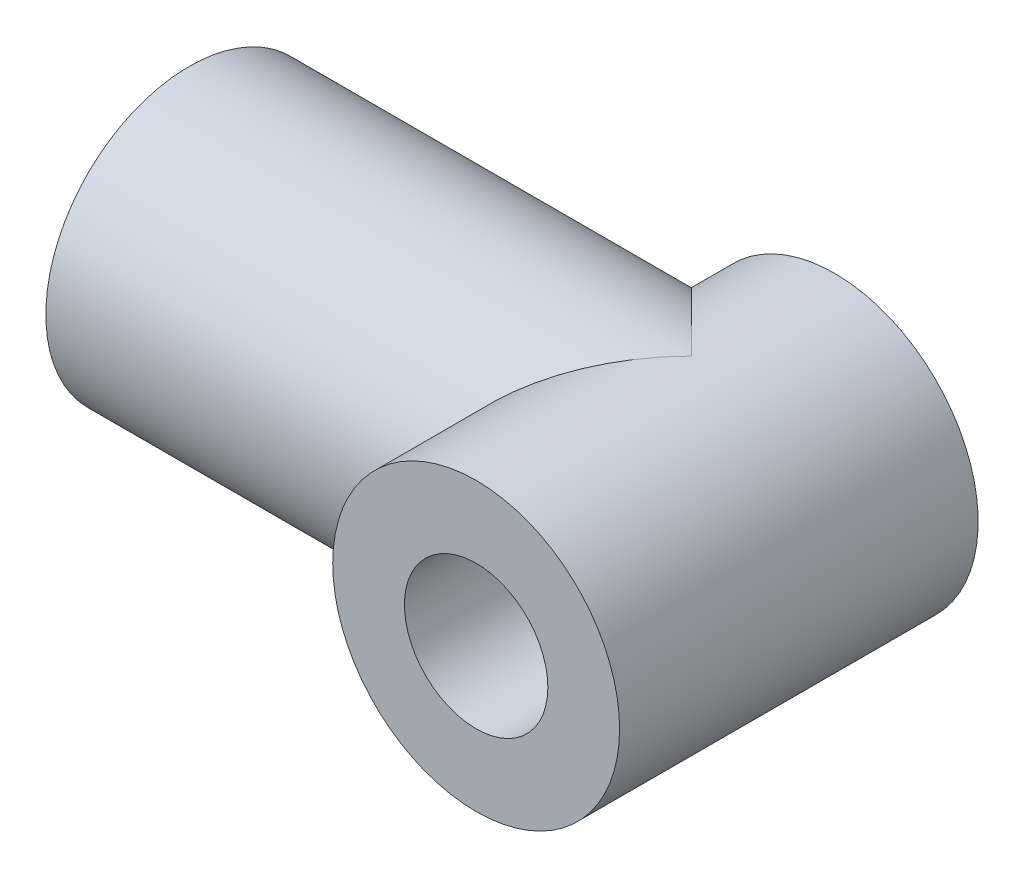
ISO-10303-21;
HEADER;
FILE_DESCRIPTION(('STEP AP214'),'2;1');
FILE_NAME('part.step','',(''),(''),'','','');
FILE_SCHEMA(('AUTOMOTIVE_DESIGN { 1 0 10303 214 1 1 1 1 }'));
ENDSEC;
DATA;
#1=APPLICATION_CONTEXT('core data for automotive mechanical design processes');
#2=APPLICATION_PROTOCOL_DEFINITION('international standard','automotive_design',2000,#1);
#3=PRODUCT_CONTEXT('',#1,'mechanical');
#4=PRODUCT('Part','Part','',(#3));
#5=PRODUCT_RELATED_PRODUCT_CATEGORY('part','',(#4));
#6=PRODUCT_DEFINITION_FORMATION('','',#4);
#7=PRODUCT_DEFINITION_CONTEXT('part definition',#1,'design');
#8=PRODUCT_DEFINITION('design','',#6,#7);
#9=PRODUCT_DEFINITION_SHAPE('','',#8);
#10=(LENGTH_UNIT() NAMED_UNIT(*) SI_UNIT(.MILLI.,.METRE.));
#11=(NAMED_UNIT(*) PLANE_ANGLE_UNIT() SI_UNIT($,.RADIAN.));
#12=(NAMED_UNIT(*) SI_UNIT($,.STERADIAN.) SOLID_ANGLE_UNIT());
#13=UNCERTAINTY_MEASURE_WITH_UNIT(LENGTH_MEASURE(1.E-05),#10,'distance_accuracy_value','');
#14=(GEOMETRIC_REPRESENTATION_CONTEXT(3) GLOBAL_UNCERTAINTY_ASSIGNED_CONTEXT((#13)) GLOBAL_UNIT_ASSIGNED_CONTEXT((#10,
#11,#12)) REPRESENTATION_CONTEXT('',''));
#15=CARTESIAN_POINT('',(0.,0.,0.));
#16=DIRECTION('',(0.,0.,1.));
#17=DIRECTION('',(1.,0.,0.));
#18=AXIS2_PLACEMENT_3D('',#15,#16,#17);
#19=CARTESIAN_POINT('',(0.,0.,15.));
#20=DIRECTION('',(0.,0.,1.));
#21=DIRECTION('',(1.,0.,0.));
#22=AXIS2_PLACEMENT_3D('',#19,#20,#21);
#23=PLANE('',#22);
#24=CARTESIAN_POINT('',(0.,0.,15.));
#25=DIRECTION('',(0.,0.,1.));
#26=DIRECTION('',(1.,0.,0.));
#27=AXIS2_PLACEMENT_3D('',#24,#25,#26);
#28=CIRCLE('',#27,6.);
#29=CARTESIAN_POINT('',(6.,0.,15.));
#30=VERTEX_POINT('',#29);
#31=EDGE_CURVE('E43',#30,#30,#28,.T.);
#32=ORIENTED_EDGE('',*,*,#31,.T.);
#33=EDGE_LOOP('',(#32));
#34=FACE_BOUND('',#33,.T.);
#35=CARTESIAN_POINT('',(0.,0.,15.));
#36=DIRECTION('',(0.,0.,1.));
#37=DIRECTION('',(1.,0.,0.));
#38=AXIS2_PLACEMENT_3D('',#35,#36,#37);
#39=CIRCLE('',#38,3.);
#40=CARTESIAN_POINT('',(3.,0.,15.));
#41=VERTEX_POINT('',#40);
#42=EDGE_CURVE('E67',#41,#41,#39,.T.);
#43=ORIENTED_EDGE('',*,*,#42,.F.);
#44=EDGE_LOOP('',(#43));
#45=FACE_BOUND('',#44,.T.);
#46=ADVANCED_FACE('F33',(#34,#45),#23,.T.);
#47=CARTESIAN_POINT('',(0.,0.,0.));
#48=DIRECTION('',(0.,0.,1.));
#49=DIRECTION('',(1.,0.,0.));
#50=AXIS2_PLACEMENT_3D('',#47,#48,#49);
#51=PLANE('',#50);
#52=CARTESIAN_POINT('',(0.,0.,0.));
#53=DIRECTION('',(0.,0.,1.));
#54=DIRECTION('',(1.,0.,0.));
#55=AXIS2_PLACEMENT_3D('',#52,#53,#54);
#56=CIRCLE('',#55,3.);
#57=CARTESIAN_POINT('',(3.,0.,0.));
#58=VERTEX_POINT('',#57);
#59=EDGE_CURVE('E65',#58,#58,#56,.T.);
#60=ORIENTED_EDGE('',*,*,#59,.T.);
#61=EDGE_LOOP('',(#60));
#62=FACE_BOUND('',#61,.T.);
#63=CARTESIAN_POINT('',(0.,0.,0.));
#64=DIRECTION('',(0.,0.,1.));
#65=DIRECTION('',(1.,0.,0.));
#66=AXIS2_PLACEMENT_3D('',#63,#64,#65);
#67=CIRCLE('',#66,6.);
#68=CARTESIAN_POINT('',(-6.,0.,0.));
#69=VERTEX_POINT('',#68);
#70=EDGE_CURVE('E38',#69,#69,#67,.T.);
#71=ORIENTED_EDGE('',*,*,#70,.F.);
#72=EDGE_LOOP('',(#71));
#73=FACE_BOUND('',#72,.T.);
#74=ADVANCED_FACE('F78',(#62,#73),#51,.F.);
#75=CARTESIAN_POINT('',(0.,0.,15.));
#76=DIRECTION('',(0.,0.,-1.));
#77=DIRECTION('',(-1.,0.,0.));
#78=AXIS2_PLACEMENT_3D('',#75,#76,#77);
#79=CYLINDRICAL_SURFACE('',#78,6.);
#80=ORIENTED_EDGE('',*,*,#31,.F.);
#81=EDGE_LOOP('',(#80));
#82=FACE_BOUND('',#81,.T.);
#83=CARTESIAN_POINT('',(0.,0.,6.));
#84=DIRECTION('',(-0.707106781186547,0.,-0.707106781186548));
#85=DIRECTION('',(0.707106781186547,0.,-0.707106781186548));
#86=AXIS2_PLACEMENT_3D('',#83,#84,#85);
#87=ELLIPSE('',#86,8.48528137423857,6.);
#88=CARTESIAN_POINT('',(0.,6.,6.));
#89=VERTEX_POINT('',#88);
#90=CARTESIAN_POINT('',(0.,-6.,6.));
#91=VERTEX_POINT('',#90);
#92=EDGE_CURVE('E57',#89,#91,#87,.F.);
#93=ORIENTED_EDGE('',*,*,#92,.T.);
#94=CARTESIAN_POINT('',(0.,0.,6.));
#95=DIRECTION('',(0.707106781186547,0.,-0.707106781186548));
#96=DIRECTION('',(-0.707106781186547,0.,-0.707106781186548));
#97=AXIS2_PLACEMENT_3D('',#94,#95,#96);
#98=ELLIPSE('',#97,8.48528137423857,6.);
#99=EDGE_CURVE('E51',#91,#69,#98,.T.);
#100=ORIENTED_EDGE('',*,*,#99,.T.);
#101=ORIENTED_EDGE('',*,*,#70,.T.);
#102=EDGE_CURVE('E55',#69,#89,#98,.T.);
#103=ORIENTED_EDGE('',*,*,#102,.T.);
#104=EDGE_LOOP('',(#93,#100,#101,#103));
#105=FACE_BOUND('',#104,.T.);
#106=ADVANCED_FACE('F35',(#82,#105),#79,.T.);
#107=CARTESIAN_POINT('',(0.,0.,15.));
#108=DIRECTION('',(0.,0.,-1.));
#109=DIRECTION('',(-1.,0.,0.));
#110=AXIS2_PLACEMENT_3D('',#107,#108,#109);
#111=CYLINDRICAL_SURFACE('',#110,3.);
#112=ORIENTED_EDGE('',*,*,#59,.F.);
#113=EDGE_LOOP('',(#112));
#114=FACE_BOUND('',#113,.T.);
#115=ORIENTED_EDGE('',*,*,#42,.T.);
#116=EDGE_LOOP('',(#115));
#117=FACE_BOUND('',#116,.T.);
#118=ADVANCED_FACE('F77',(#114,#117),#111,.F.);
#119=CARTESIAN_POINT('',(-21.,0.,6.));
#120=DIRECTION('',(1.,0.,0.));
#121=DIRECTION('',(0.,0.,-1.));
#122=AXIS2_PLACEMENT_3D('',#119,#120,#121);
#123=CYLINDRICAL_SURFACE('',#122,6.);
#124=CARTESIAN_POINT('',(-21.,0.,6.));
#125=DIRECTION('',(1.,0.,0.));
#126=DIRECTION('',(0.,0.,-1.));
#127=AXIS2_PLACEMENT_3D('',#124,#125,#126);
#128=CIRCLE('',#127,6.);
#129=CARTESIAN_POINT('',(-21.,0.,0.));
#130=VERTEX_POINT('',#129);
#131=EDGE_CURVE('E60',#130,#130,#128,.T.);
#132=ORIENTED_EDGE('',*,*,#131,.T.);
#133=EDGE_LOOP('',(#132));
#134=FACE_BOUND('',#133,.T.);
#135=ORIENTED_EDGE('',*,*,#99,.F.);
#136=ORIENTED_EDGE('',*,*,#92,.F.);
#137=ORIENTED_EDGE('',*,*,#102,.F.);
#138=EDGE_LOOP('',(#135,#136,#137));
#139=FACE_BOUND('',#138,.T.);
#140=ADVANCED_FACE('F58',(#134,#139),#123,.T.);
#141=CARTESIAN_POINT('',(-21.,0.,6.));
#142=DIRECTION('',(1.,0.,0.));
#143=DIRECTION('',(0.,0.,-1.));
#144=AXIS2_PLACEMENT_3D('',#141,#142,#143);
#145=CYLINDRICAL_SURFACE('',#144,3.);
#146=CARTESIAN_POINT('',(-21.,0.,6.));
#147=DIRECTION('',(1.,0.,0.));
#148=DIRECTION('',(0.,0.,-1.));
#149=AXIS2_PLACEMENT_3D('',#146,#147,#148);
#150=CIRCLE('',#149,3.);
#151=CARTESIAN_POINT('',(-21.,0.,3.));
#152=VERTEX_POINT('',#151);
#153=EDGE_CURVE('E112',#152,#152,#150,.T.);
#154=ORIENTED_EDGE('',*,*,#153,.F.);
#155=EDGE_LOOP('',(#154));
#156=FACE_BOUND('',#155,.T.);
#157=CARTESIAN_POINT('',(-6.,0.,9.));
#158=CARTESIAN_POINT('',(-5.99999934964153,-0.0788941476270899,8.99999916125948));
#159=CARTESIAN_POINT('',(-5.99843869002385,-0.15779662040795,8.99688205452446));
#160=CARTESIAN_POINT('',(-5.99224358793258,-0.315001991255922,8.98446072826002));
#161=CARTESIAN_POINT('',(-5.98760776295702,-0.393304603620535,8.97515372593455));
#162=CARTESIAN_POINT('',(-5.96921978027472,-0.626628691373742,8.93804214318136));
#163=CARTESIAN_POINT('',(-5.95098734455496,-0.779952894844981,8.90104717093731));
#164=CARTESIAN_POINT('',(-5.90448966743082,-1.07683586335997,8.80441822557076));
#165=CARTESIAN_POINT('',(-5.87626344365679,-1.22043005484385,8.74487223379164));
#166=CARTESIAN_POINT('',(-5.81237302716333,-1.49540820515375,8.60528874932114));
#167=CARTESIAN_POINT('',(-5.77670942093694,-1.62679312559149,8.52525287229669));
#168=CARTESIAN_POINT('',(-5.69868752298932,-1.88252701271777,8.34144601915048));
#169=CARTESIAN_POINT('',(-5.65605474586614,-2.0059694541685,8.23653205247863));
#170=CARTESIAN_POINT('',(-5.56980033629331,-2.23433451090185,8.00844407851344));
#171=CARTESIAN_POINT('',(-5.5261779786051,-2.33924301355731,7.88525628683475));
#172=CARTESIAN_POINT('',(-5.43896347969577,-2.53576864722249,7.61251563991825));
#173=CARTESIAN_POINT('',(-5.39563602686729,-2.62572411176601,7.46165902554178));
#174=CARTESIAN_POINT('',(-5.33782449719395,-2.7403403145029,7.22404914597679));
#175=CARTESIAN_POINT('',(-5.31974570840245,-2.77516786882118,7.14292907543726));
#176=CARTESIAN_POINT('',(-5.28665768365287,-2.83769299596485,6.97739942011955));
#177=CARTESIAN_POINT('',(-5.27164663543394,-2.86539478083936,6.89299181274237));
#178=CARTESIAN_POINT('',(-5.24610341708083,-2.91188280266506,6.72660420323777));
#179=CARTESIAN_POINT('',(-5.23535838565202,-2.93110042292907,6.64477720324351));
#180=CARTESIAN_POINT('',(-5.21757784151146,-2.9626355938468,6.4794450914804));
#181=CARTESIAN_POINT('',(-5.21054036082126,-2.97495680535109,6.39594089445929));
#182=CARTESIAN_POINT('',(-5.20047756645272,-2.99251382412705,6.22799363258377));
#183=CARTESIAN_POINT('',(-5.19744983647106,-2.99775389857938,6.14355116410634));
#184=CARTESIAN_POINT('',(-5.19552555967191,-3.00108452416055,5.97450634565856));
#185=CARTESIAN_POINT('',(-5.19662861870362,-2.9991757574161,5.88990401171214));
#186=CARTESIAN_POINT('',(-5.20534668059274,-2.98404973540404,5.65724610167769));
#187=CARTESIAN_POINT('',(-5.21726794353739,-2.96335042632723,5.50975584584563));
#188=CARTESIAN_POINT('',(-5.25228182412118,-2.90082280036694,5.22080632317494));
#189=CARTESIAN_POINT('',(-5.2753780002338,-2.85898775295595,5.07934899304936));
#190=CARTESIAN_POINT('',(-5.33062568888728,-2.75462843937304,4.80232034970317));
#191=CARTESIAN_POINT('',(-5.36297559567996,-2.69164495870316,4.66696288824886));
#192=CARTESIAN_POINT('',(-5.43310175251307,-2.54712530575799,4.40809503668597));
#193=CARTESIAN_POINT('',(-5.47088043711311,-2.46558080007524,4.28459000351952));
#194=CARTESIAN_POINT('',(-5.55339485686877,-2.27419808739746,4.03643690622019));
#195=CARTESIAN_POINT('',(-5.59840533924979,-2.16208335434885,3.9136295576159));
#196=CARTESIAN_POINT('',(-5.6864286668495,-1.91866675699301,3.68779356579794));
#197=CARTESIAN_POINT('',(-5.72944054996685,-1.78735577540359,3.58477437509414));
#198=CARTESIAN_POINT('',(-5.81105962769461,-1.50154951155102,3.39694306798137));
#199=CARTESIAN_POINT('',(-5.84936952731879,-1.3462607732106,3.31319859630242));
#200=CARTESIAN_POINT('',(-5.91473643118065,-1.02139864805275,3.17370889924219));
#201=CARTESIAN_POINT('',(-5.94180236767508,-0.851836729203681,3.11794144145035));
#202=CARTESIAN_POINT('',(-5.97973001282228,-0.518299474608032,3.04057379206389));
#203=CARTESIAN_POINT('',(-5.99174814919366,-0.355024591545113,3.01652629361826));
#204=CARTESIAN_POINT('',(-6.00219040361882,-0.0263387999478724,2.99560580573834));
#205=CARTESIAN_POINT('',(-6.00062096160122,0.13907105958427,2.99871994286048));
#206=CARTESIAN_POINT('',(-5.98473576763842,0.453698915981444,3.03062006546021));
#207=CARTESIAN_POINT('',(-5.97141737064974,0.60317822415514,3.05739759824394));
#208=CARTESIAN_POINT('',(-5.93466513944052,0.895220676900473,3.1327142156314));
#209=CARTESIAN_POINT('',(-5.91123019004896,1.03778305707535,3.18125569934861));
#210=CARTESIAN_POINT('',(-5.85552754239056,1.31666582534657,3.29999539931131));
#211=CARTESIAN_POINT('',(-5.82302645301465,1.45269119100304,3.37077315034128));
#212=CARTESIAN_POINT('',(-5.75231922959683,1.71138408511219,3.53132260694728));
#213=CARTESIAN_POINT('',(-5.71411066728832,1.83404588938514,3.62110240382873));
#214=CARTESIAN_POINT('',(-5.63124663977895,2.07530306780484,3.82728127594372));
#215=CARTESIAN_POINT('',(-5.58632654410486,2.19231623321556,3.94542860514479));
#216=CARTESIAN_POINT('',(-5.49787174706805,2.40556896301298,4.1997754536848));
#217=CARTESIAN_POINT('',(-5.4543380217028,2.50179415686851,4.33598735658041));
#218=CARTESIAN_POINT('',(-5.3715357665078,2.675123743717,4.63093096248033));
#219=CARTESIAN_POINT('',(-5.33257588763925,2.75107648817021,4.79043379796257));
#220=CARTESIAN_POINT('',(-5.26722216885657,2.87424847703564,5.12253020304536));
#221=CARTESIAN_POINT('',(-5.24081214709482,2.92150474480837,5.2951065806432));
#222=CARTESIAN_POINT('',(-5.2068450303742,2.98158506492521,5.63073066753087));
#223=CARTESIAN_POINT('',(-5.19772150245585,2.997278998202,5.79310275629028));
#224=CARTESIAN_POINT('',(-5.19496064074354,3.00206745414686,6.11834120550728));
#225=CARTESIAN_POINT('',(-5.20131659437267,2.99117350647291,6.28120732114266));
#226=CARTESIAN_POINT('',(-5.22713585648299,2.94577840699521,6.58645049109345));
#227=CARTESIAN_POINT('',(-5.24529281646867,2.91362505078137,6.72930136226562));
#228=CARTESIAN_POINT('',(-5.29113050364646,2.82952596688629,7.0074244064572));
#229=CARTESIAN_POINT('',(-5.3188142941166,2.77757387249734,7.14269412552796));
#230=CARTESIAN_POINT('',(-5.38285583940632,2.65144766382427,7.41187436166464));
#231=CARTESIAN_POINT('',(-5.41967139666624,2.57601505988081,7.54508296947888));
#232=CARTESIAN_POINT('',(-5.49706022440067,2.40645126762009,7.7978243449357));
#233=CARTESIAN_POINT('',(-5.53763544397051,2.31231035120759,7.91734994640441));
#234=CARTESIAN_POINT('',(-5.62386853947507,2.094616891292,8.15442285748806));
#235=CARTESIAN_POINT('',(-5.66954494371953,1.96888052183389,8.2699651241614));
#236=CARTESIAN_POINT('',(-5.75633712356327,1.69843715077041,8.47880114007097));
#237=CARTESIAN_POINT('',(-5.79745043456127,1.55371998850183,8.57208289702219));
#238=CARTESIAN_POINT('',(-5.85251406841986,1.32452333533412,8.69317818455659));
#239=CARTESIAN_POINT('',(-5.86982524242744,1.24575314775787,8.73052020024159));
#240=CARTESIAN_POINT('',(-5.90168845962536,1.08479725492719,8.79836167882379));
#241=CARTESIAN_POINT('',(-5.91624185523758,1.00261324805381,8.82886449703348));
#242=CARTESIAN_POINT('',(-5.94212690185115,0.835616997915664,8.88260725599252));
#243=CARTESIAN_POINT('',(-5.95346557615479,0.750810940130687,8.90586304076398));
#244=CARTESIAN_POINT('',(-5.97260771878739,0.579142357408355,8.94488257278059));
#245=CARTESIAN_POINT('',(-5.98041334646939,0.49228112282551,8.96065089655644));
#246=CARTESIAN_POINT('',(-5.99085829855372,0.337824895315462,8.98168467861349));
#247=CARTESIAN_POINT('',(-5.99428035414515,0.270495162095328,8.98854691772596));
#248=CARTESIAN_POINT('',(-5.99885151538357,0.135445671381779,8.99770500144305));
#249=CARTESIAN_POINT('',(-6.00000055829382,0.0677259031748616,9.00000072000853));
#250=CARTESIAN_POINT('',(-6.,0.,9.));
#251=B_SPLINE_CURVE_WITH_KNOTS('',3,(#157,#158,#159,#160,#161,#162,#163,#164,#165,#166,#167,
#168,#169,#170,#171,#172,#173,#174,#175,#176,#177,#178,#179,#180,#181,#182,#183,#184,#185,#186,
#187,#188,#189,#190,#191,#192,#193,#194,#195,#196,#197,#198,#199,#200,#201,#202,#203,#204,#205,
#206,#207,#208,#209,#210,#211,#212,#213,#214,#215,#216,#217,#218,#219,#220,#221,#222,#223,#224,
#225,#226,#227,#228,#229,#230,#231,#232,#233,#234,#235,#236,#237,#238,#239,#240,#241,#242,#243,
#244,#245,#246,#247,#248,#249,#250),.UNSPECIFIED.,.T.,.F.,(4,2,2,2,2,2,2,2,2,2,2,2,2,2,2,2,2,2,
2,2,2,2,2,2,2,2,2,2,2,2,2,2,2,2,2,2,2,2,2,2,2,2,2,2,2,2,4),(0.,0.236611432443576,
0.4733293104377,0.947100987304415,1.41904300465372,1.89094781992153,2.39140181433109,
2.89223525113893,3.4319083310994,3.70192714967837,3.97178599119154,4.2256372003331,
4.47935352842581,4.73291689564224,4.98645606901568,5.43238672147391,5.87845946700878,
6.33492255429305,6.79159098704508,7.30616358925478,7.82098138719902,8.35970601567165,
8.89800185660681,9.3917140633788,9.88519228458271,10.3404225444221,10.7957029981664,
11.2640010300754,11.7324988716886,12.2470036685628,12.7618630076938,13.3016558140826,
13.8407507075944,14.3280945743223,14.8152271451712,15.2559532566965,15.6968212128814,
16.1673090526395,16.6380421835398,17.1659726319345,17.6941868506379,17.9605054214138,
18.2266930489272,18.4922945660822,18.7577335310501,18.9608446764332,19.1639614277476),.UNSPECIFIED.);
#252=CARTESIAN_POINT('',(-6.,0.,9.));
#253=VERTEX_POINT('',#252);
#254=EDGE_CURVE('E11',#253,#253,#251,.T.);
#255=ORIENTED_EDGE('',*,*,#254,.T.);
#256=EDGE_LOOP('',(#255));
#257=FACE_BOUND('',#256,.T.);
#258=ADVANCED_FACE('F99',(#156,#257),#145,.F.);
#259=CARTESIAN_POINT('',(-21.,0.,6.));
#260=DIRECTION('',(1.,0.,0.));
#261=DIRECTION('',(0.,0.,-1.));
#262=AXIS2_PLACEMENT_3D('',#259,#260,#261);
#263=PLANE('',#262);
#264=ORIENTED_EDGE('',*,*,#153,.T.);
#265=EDGE_LOOP('',(#264));
#266=FACE_BOUND('',#265,.T.);
#267=ORIENTED_EDGE('',*,*,#131,.F.);
#268=EDGE_LOOP('',(#267));
#269=FACE_BOUND('',#268,.T.);
#270=ADVANCED_FACE('F90',(#266,#269),#263,.F.);
#271=ORIENTED_EDGE('',*,*,#254,.F.);
#272=EDGE_LOOP('',(#271));
#273=FACE_BOUND('',#272,.T.);
#274=ADVANCED_FACE('F79',(#273),#79,.T.);
#275=CLOSED_SHELL('',(#46,#74,#106,#118,#140,#258,#270,#274));
#276=MANIFOLD_SOLID_BREP('B2',#275);
#277=ADVANCED_BREP_SHAPE_REPRESENTATION('',(#18,#276),#14);
#278=SHAPE_DEFINITION_REPRESENTATION(#9,#277);
ENDSEC;
END-ISO-10303-21;
